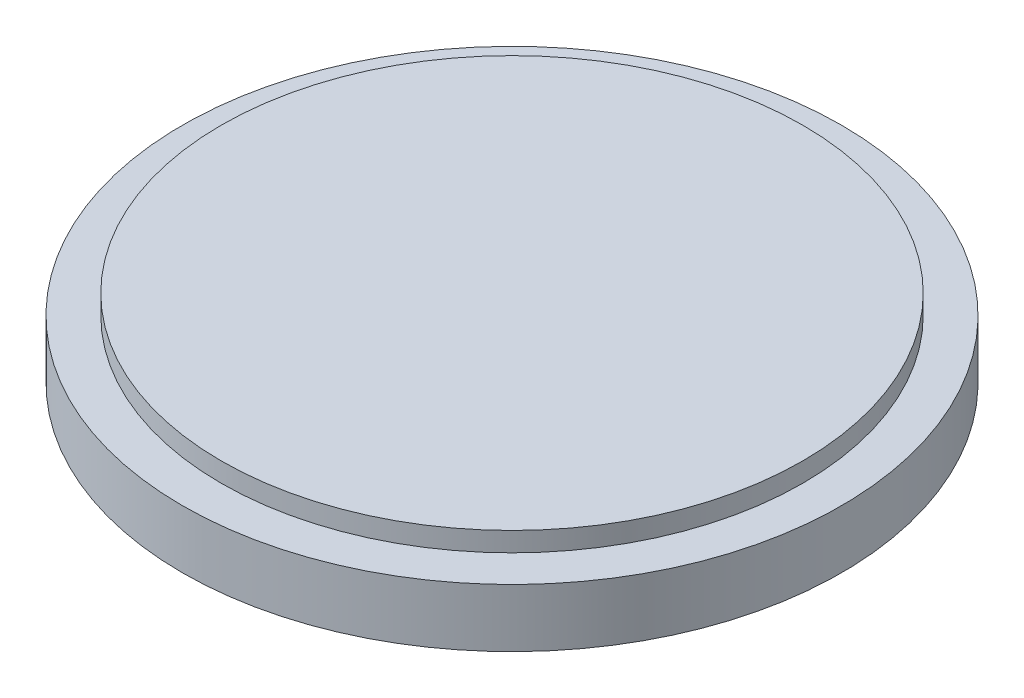
ISO-10303-21;
HEADER;
FILE_DESCRIPTION(('STEP AP214'),'2;1');
FILE_NAME('part.step','',(''),(''),'','','');
FILE_SCHEMA(('AUTOMOTIVE_DESIGN { 1 0 10303 214 1 1 1 1 }'));
ENDSEC;
DATA;
#1=APPLICATION_CONTEXT('core data for automotive mechanical design processes');
#2=APPLICATION_PROTOCOL_DEFINITION('international standard','automotive_design',2000,#1);
#3=PRODUCT_CONTEXT('',#1,'mechanical');
#4=PRODUCT('Part','Part','',(#3));
#5=PRODUCT_RELATED_PRODUCT_CATEGORY('part','',(#4));
#6=PRODUCT_DEFINITION_FORMATION('','',#4);
#7=PRODUCT_DEFINITION_CONTEXT('part definition',#1,'design');
#8=PRODUCT_DEFINITION('design','',#6,#7);
#9=PRODUCT_DEFINITION_SHAPE('','',#8);
#10=(LENGTH_UNIT() NAMED_UNIT(*) SI_UNIT(.MILLI.,.METRE.));
#11=(NAMED_UNIT(*) PLANE_ANGLE_UNIT() SI_UNIT($,.RADIAN.));
#12=(NAMED_UNIT(*) SI_UNIT($,.STERADIAN.) SOLID_ANGLE_UNIT());
#13=UNCERTAINTY_MEASURE_WITH_UNIT(LENGTH_MEASURE(1.E-05),#10,'distance_accuracy_value','');
#14=(GEOMETRIC_REPRESENTATION_CONTEXT(3) GLOBAL_UNCERTAINTY_ASSIGNED_CONTEXT((#13)) GLOBAL_UNIT_ASSIGNED_CONTEXT((#10,
#11,#12)) REPRESENTATION_CONTEXT('',''));
#15=CARTESIAN_POINT('',(0.,0.,0.));
#16=DIRECTION('',(0.,0.,1.));
#17=DIRECTION('',(1.,0.,0.));
#18=AXIS2_PLACEMENT_3D('',#15,#16,#17);
#19=CARTESIAN_POINT('',(0.,5.,0.));
#20=DIRECTION('',(0.,-1.,0.));
#21=DIRECTION('',(0.,0.,-1.));
#22=AXIS2_PLACEMENT_3D('',#19,#20,#21);
#23=CYLINDRICAL_SURFACE('',#22,75.);
#24=CARTESIAN_POINT('',(0.,5.,0.));
#25=DIRECTION('',(0.,1.,0.));
#26=DIRECTION('',(0.,0.,1.));
#27=AXIS2_PLACEMENT_3D('',#24,#25,#26);
#28=CIRCLE('',#27,75.);
#29=CARTESIAN_POINT('',(0.,5.,75.));
#30=VERTEX_POINT('',#29);
#31=EDGE_CURVE('E10',#30,#30,#28,.T.);
#32=ORIENTED_EDGE('',*,*,#31,.F.);
#33=EDGE_LOOP('',(#32));
#34=FACE_BOUND('',#33,.T.);
#35=CARTESIAN_POINT('',(0.,0.,0.));
#36=DIRECTION('',(0.,1.,0.));
#37=DIRECTION('',(0.,0.,1.));
#38=AXIS2_PLACEMENT_3D('',#35,#36,#37);
#39=CIRCLE('',#38,75.);
#40=CARTESIAN_POINT('',(0.,0.,75.));
#41=VERTEX_POINT('',#40);
#42=EDGE_CURVE('E41',#41,#41,#39,.T.);
#43=ORIENTED_EDGE('',*,*,#42,.T.);
#44=EDGE_LOOP('',(#43));
#45=FACE_BOUND('',#44,.T.);
#46=ADVANCED_FACE('F38',(#34,#45),#23,.T.);
#47=CARTESIAN_POINT('',(0.,5.,0.));
#48=DIRECTION('',(0.,1.,0.));
#49=DIRECTION('',(0.,0.,1.));
#50=AXIS2_PLACEMENT_3D('',#47,#48,#49);
#51=PLANE('',#50);
#52=ORIENTED_EDGE('',*,*,#31,.T.);
#53=EDGE_LOOP('',(#52));
#54=FACE_BOUND('',#53,.T.);
#55=ADVANCED_FACE('F65',(#54),#51,.T.);
#56=CARTESIAN_POINT('',(0.,-15.,0.));
#57=DIRECTION('',(0.,1.,0.));
#58=DIRECTION('',(0.,0.,1.));
#59=AXIS2_PLACEMENT_3D('',#56,#57,#58);
#60=CYLINDRICAL_SURFACE('',#59,85.);
#61=CARTESIAN_POINT('',(0.,-15.,0.));
#62=DIRECTION('',(0.,-1.,0.));
#63=DIRECTION('',(0.,0.,-1.));
#64=AXIS2_PLACEMENT_3D('',#61,#62,#63);
#65=CIRCLE('',#64,85.);
#66=CARTESIAN_POINT('',(0.,-15.,-85.));
#67=VERTEX_POINT('',#66);
#68=EDGE_CURVE('E51',#67,#67,#65,.T.);
#69=ORIENTED_EDGE('',*,*,#68,.F.);
#70=EDGE_LOOP('',(#69));
#71=FACE_BOUND('',#70,.T.);
#72=CARTESIAN_POINT('',(0.,0.,0.));
#73=DIRECTION('',(0.,-1.,0.));
#74=DIRECTION('',(0.,0.,-1.));
#75=AXIS2_PLACEMENT_3D('',#72,#73,#74);
#76=CIRCLE('',#75,85.);
#77=CARTESIAN_POINT('',(0.,0.,-85.));
#78=VERTEX_POINT('',#77);
#79=EDGE_CURVE('E53',#78,#78,#76,.T.);
#80=ORIENTED_EDGE('',*,*,#79,.T.);
#81=EDGE_LOOP('',(#80));
#82=FACE_BOUND('',#81,.T.);
#83=ADVANCED_FACE('F62',(#71,#82),#60,.T.);
#84=CARTESIAN_POINT('',(0.,-15.,0.));
#85=DIRECTION('',(0.,-1.,0.));
#86=DIRECTION('',(0.,0.,-1.));
#87=AXIS2_PLACEMENT_3D('',#84,#85,#86);
#88=PLANE('',#87);
#89=ORIENTED_EDGE('',*,*,#68,.T.);
#90=EDGE_LOOP('',(#89));
#91=FACE_BOUND('',#90,.T.);
#92=ADVANCED_FACE('F60',(#91),#88,.T.);
#93=CARTESIAN_POINT('',(0.,0.,0.));
#94=DIRECTION('',(0.,-1.,0.));
#95=DIRECTION('',(0.,0.,-1.));
#96=AXIS2_PLACEMENT_3D('',#93,#94,#95);
#97=PLANE('',#96);
#98=ORIENTED_EDGE('',*,*,#42,.F.);
#99=EDGE_LOOP('',(#98));
#100=FACE_BOUND('',#99,.T.);
#101=ORIENTED_EDGE('',*,*,#79,.F.);
#102=EDGE_LOOP('',(#101));
#103=FACE_BOUND('',#102,.T.);
#104=ADVANCED_FACE('F69',(#100,#103),#97,.F.);
#105=CLOSED_SHELL('',(#46,#55,#83,#92,#104));
#106=MANIFOLD_SOLID_BREP('B2',#105);
#107=ADVANCED_BREP_SHAPE_REPRESENTATION('',(#18,#106),#14);
#108=SHAPE_DEFINITION_REPRESENTATION(#9,#107);
ENDSEC;
END-ISO-10303-21;
